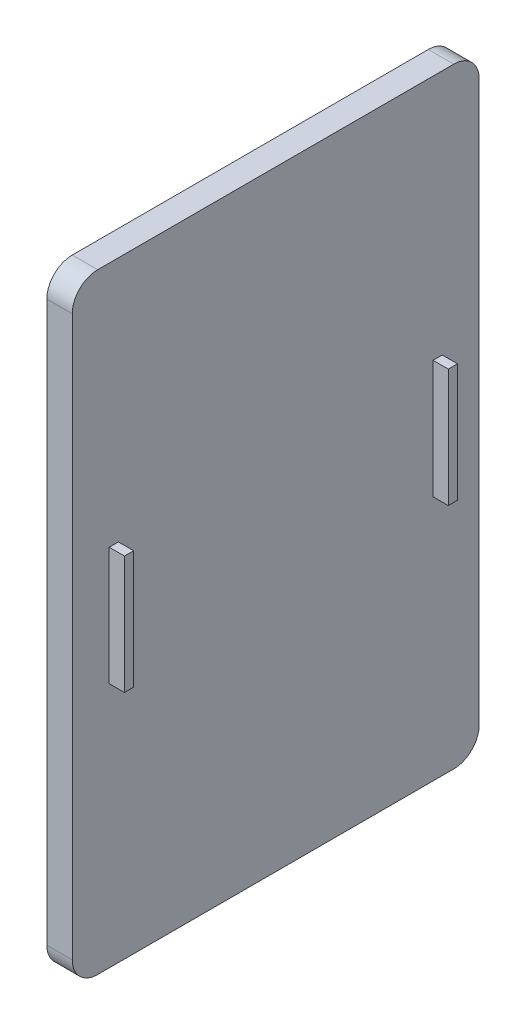
ISO-10303-21;
HEADER;
FILE_DESCRIPTION(('STEP AP214'),'2;1');
FILE_NAME('part.step','',(''),(''),'','','');
FILE_SCHEMA(('AUTOMOTIVE_DESIGN { 1 0 10303 214 1 1 1 1 }'));
ENDSEC;
DATA;
#1=APPLICATION_CONTEXT('core data for automotive mechanical design processes');
#2=APPLICATION_PROTOCOL_DEFINITION('international standard','automotive_design',2000,#1);
#3=PRODUCT_CONTEXT('',#1,'mechanical');
#4=PRODUCT('Part','Part','',(#3));
#5=PRODUCT_RELATED_PRODUCT_CATEGORY('part','',(#4));
#6=PRODUCT_DEFINITION_FORMATION('','',#4);
#7=PRODUCT_DEFINITION_CONTEXT('part definition',#1,'design');
#8=PRODUCT_DEFINITION('design','',#6,#7);
#9=PRODUCT_DEFINITION_SHAPE('','',#8);
#10=(LENGTH_UNIT() NAMED_UNIT(*) SI_UNIT(.MILLI.,.METRE.));
#11=(NAMED_UNIT(*) PLANE_ANGLE_UNIT() SI_UNIT($,.RADIAN.));
#12=(NAMED_UNIT(*) SI_UNIT($,.STERADIAN.) SOLID_ANGLE_UNIT());
#13=UNCERTAINTY_MEASURE_WITH_UNIT(LENGTH_MEASURE(1.E-05),#10,'distance_accuracy_value','');
#14=(GEOMETRIC_REPRESENTATION_CONTEXT(3) GLOBAL_UNCERTAINTY_ASSIGNED_CONTEXT((#13)) GLOBAL_UNIT_ASSIGNED_CONTEXT((#10,
#11,#12)) REPRESENTATION_CONTEXT('',''));
#15=CARTESIAN_POINT('',(0.,0.,0.));
#16=DIRECTION('',(0.,0.,1.));
#17=DIRECTION('',(1.,0.,0.));
#18=AXIS2_PLACEMENT_3D('',#15,#16,#17);
#19=CARTESIAN_POINT('',(5.,0.,0.));
#20=DIRECTION('',(1.,0.,0.));
#21=DIRECTION('',(0.,0.,-1.));
#22=AXIS2_PLACEMENT_3D('',#19,#20,#21);
#23=PLANE('',#22);
#24=DIRECTION('',(0.,1.,0.));
#25=VECTOR('',#24,1.);
#26=CARTESIAN_POINT('',(5.,11.6153180634238,-30.9245104378546));
#27=LINE('',#26,#25);
#28=CARTESIAN_POINT('',(5.,-11.6153180634238,-30.9245104378546));
#29=VERTEX_POINT('',#28);
#30=CARTESIAN_POINT('',(5.,11.6153180634238,-30.9245104378546));
#31=VERTEX_POINT('',#30);
#32=EDGE_CURVE('E151',#29,#31,#27,.T.);
#33=ORIENTED_EDGE('',*,*,#32,.T.);
#34=DIRECTION('',(0.,0.,-1.));
#35=VECTOR('',#34,1.);
#36=CARTESIAN_POINT('',(5.,11.6153180634238,-32.7289287815984));
#37=LINE('',#36,#35);
#38=CARTESIAN_POINT('',(5.,11.6153180634238,-32.7289287815984));
#39=VERTEX_POINT('',#38);
#40=EDGE_CURVE('E165',#31,#39,#37,.T.);
#41=ORIENTED_EDGE('',*,*,#40,.T.);
#42=DIRECTION('',(0.,-1.,0.));
#43=VECTOR('',#42,1.);
#44=CARTESIAN_POINT('',(5.,11.6153180634238,-32.7289287815984));
#45=LINE('',#44,#43);
#46=CARTESIAN_POINT('',(5.,-11.6153180634238,-32.7289287815984));
#47=VERTEX_POINT('',#46);
#48=EDGE_CURVE('E53',#39,#47,#45,.T.);
#49=ORIENTED_EDGE('',*,*,#48,.T.);
#50=DIRECTION('',(0.,0.,1.));
#51=VECTOR('',#50,1.);
#52=CARTESIAN_POINT('',(5.,-11.6153180634238,-32.7289287815984));
#53=LINE('',#52,#51);
#54=EDGE_CURVE('E48',#47,#29,#53,.T.);
#55=ORIENTED_EDGE('',*,*,#54,.T.);
#56=EDGE_LOOP('',(#33,#41,#49,#55));
#57=FACE_BOUND('',#56,.T.);
#58=DIRECTION('',(0.,-1.,0.));
#59=VECTOR('',#58,1.);
#60=CARTESIAN_POINT('',(5.,60.,40.));
#61=LINE('',#60,#59);
#62=CARTESIAN_POINT('',(5.,55.,40.));
#63=VERTEX_POINT('',#62);
#64=CARTESIAN_POINT('',(5.,-55.,40.));
#65=VERTEX_POINT('',#64);
#66=EDGE_CURVE('E219',#63,#65,#61,.T.);
#67=ORIENTED_EDGE('',*,*,#66,.T.);
#68=CARTESIAN_POINT('',(5.,-55.,35.));
#69=DIRECTION('',(1.,0.,0.));
#70=DIRECTION('',(0.,0.,-1.));
#71=AXIS2_PLACEMENT_3D('',#68,#69,#70);
#72=CIRCLE('',#71,5.);
#73=CARTESIAN_POINT('',(5.,-60.,35.));
#74=VERTEX_POINT('',#73);
#75=EDGE_CURVE('E259',#65,#74,#72,.T.);
#76=ORIENTED_EDGE('',*,*,#75,.T.);
#77=DIRECTION('',(0.,0.,-1.));
#78=VECTOR('',#77,1.);
#79=CARTESIAN_POINT('',(5.,-60.,40.));
#80=LINE('',#79,#78);
#81=CARTESIAN_POINT('',(5.,-60.,-35.));
#82=VERTEX_POINT('',#81);
#83=EDGE_CURVE('E222',#74,#82,#80,.T.);
#84=ORIENTED_EDGE('',*,*,#83,.T.);
#85=CARTESIAN_POINT('',(5.,-55.,-35.));
#86=DIRECTION('',(1.,0.,0.));
#87=DIRECTION('',(0.,0.,-1.));
#88=AXIS2_PLACEMENT_3D('',#85,#86,#87);
#89=CIRCLE('',#88,5.);
#90=CARTESIAN_POINT('',(5.,-55.,-40.));
#91=VERTEX_POINT('',#90);
#92=EDGE_CURVE('E257',#82,#91,#89,.T.);
#93=ORIENTED_EDGE('',*,*,#92,.T.);
#94=DIRECTION('',(0.,1.,0.));
#95=VECTOR('',#94,1.);
#96=CARTESIAN_POINT('',(5.,60.,-40.));
#97=LINE('',#96,#95);
#98=CARTESIAN_POINT('',(5.,55.,-40.));
#99=VERTEX_POINT('',#98);
#100=EDGE_CURVE('E212',#91,#99,#97,.T.);
#101=ORIENTED_EDGE('',*,*,#100,.T.);
#102=CARTESIAN_POINT('',(5.,55.,-35.));
#103=DIRECTION('',(1.,0.,0.));
#104=DIRECTION('',(0.,0.,-1.));
#105=AXIS2_PLACEMENT_3D('',#102,#103,#104);
#106=CIRCLE('',#105,5.);
#107=CARTESIAN_POINT('',(5.,60.,-35.));
#108=VERTEX_POINT('',#107);
#109=EDGE_CURVE('E255',#99,#108,#106,.T.);
#110=ORIENTED_EDGE('',*,*,#109,.T.);
#111=DIRECTION('',(0.,0.,1.));
#112=VECTOR('',#111,1.);
#113=CARTESIAN_POINT('',(5.,60.,40.));
#114=LINE('',#113,#112);
#115=CARTESIAN_POINT('',(5.,60.,35.));
#116=VERTEX_POINT('',#115);
#117=EDGE_CURVE('E215',#108,#116,#114,.T.);
#118=ORIENTED_EDGE('',*,*,#117,.T.);
#119=CARTESIAN_POINT('',(5.,55.,35.));
#120=DIRECTION('',(1.,0.,0.));
#121=DIRECTION('',(0.,0.,-1.));
#122=AXIS2_PLACEMENT_3D('',#119,#120,#121);
#123=CIRCLE('',#122,5.);
#124=EDGE_CURVE('E253',#116,#63,#123,.T.);
#125=ORIENTED_EDGE('',*,*,#124,.T.);
#126=EDGE_LOOP('',(#67,#76,#84,#93,#101,#110,#118,#125));
#127=FACE_BOUND('',#126,.T.);
#128=DIRECTION('',(0.,0.,1.));
#129=VECTOR('',#128,1.);
#130=CARTESIAN_POINT('',(5.,11.6153180634238,32.7289287815984));
#131=LINE('',#130,#129);
#132=CARTESIAN_POINT('',(5.,11.6153180634238,30.9245104378546));
#133=VERTEX_POINT('',#132);
#134=CARTESIAN_POINT('',(5.,11.6153180634238,32.7289287815984));
#135=VERTEX_POINT('',#134);
#136=EDGE_CURVE('E196',#133,#135,#131,.T.);
#137=ORIENTED_EDGE('',*,*,#136,.F.);
#138=DIRECTION('',(0.,1.,0.));
#139=VECTOR('',#138,1.);
#140=CARTESIAN_POINT('',(5.,11.6153180634238,30.9245104378546));
#141=LINE('',#140,#139);
#142=CARTESIAN_POINT('',(5.,-11.6153180634238,30.9245104378546));
#143=VERTEX_POINT('',#142);
#144=EDGE_CURVE('E154',#143,#133,#141,.T.);
#145=ORIENTED_EDGE('',*,*,#144,.F.);
#146=DIRECTION('',(0.,0.,-1.));
#147=VECTOR('',#146,1.);
#148=CARTESIAN_POINT('',(5.,-11.6153180634238,32.7289287815984));
#149=LINE('',#148,#147);
#150=CARTESIAN_POINT('',(5.,-11.6153180634238,32.7289287815984));
#151=VERTEX_POINT('',#150);
#152=EDGE_CURVE('E187',#151,#143,#149,.T.);
#153=ORIENTED_EDGE('',*,*,#152,.F.);
#154=DIRECTION('',(0.,-1.,0.));
#155=VECTOR('',#154,1.);
#156=CARTESIAN_POINT('',(5.,11.6153180634238,32.7289287815984));
#157=LINE('',#156,#155);
#158=EDGE_CURVE('E198',#135,#151,#157,.T.);
#159=ORIENTED_EDGE('',*,*,#158,.F.);
#160=EDGE_LOOP('',(#137,#145,#153,#159));
#161=FACE_BOUND('',#160,.T.);
#162=ADVANCED_FACE('F33',(#57,#127,#161),#23,.T.);
#163=CARTESIAN_POINT('',(5.,60.,-40.));
#164=DIRECTION('',(0.,0.,1.));
#165=DIRECTION('',(0.,-1.,0.));
#166=AXIS2_PLACEMENT_3D('',#163,#164,#165);
#167=PLANE('',#166);
#168=ORIENTED_EDGE('',*,*,#100,.F.);
#169=DIRECTION('',(-1.,0.,0.));
#170=VECTOR('',#169,1.);
#171=CARTESIAN_POINT('',(5.,-55.,-40.));
#172=LINE('',#171,#170);
#173=CARTESIAN_POINT('',(0.,-55.,-40.));
#174=VERTEX_POINT('',#173);
#175=EDGE_CURVE('E263',#91,#174,#172,.T.);
#176=ORIENTED_EDGE('',*,*,#175,.T.);
#177=DIRECTION('',(0.,1.,0.));
#178=VECTOR('',#177,1.);
#179=CARTESIAN_POINT('',(0.,60.,-40.));
#180=LINE('',#179,#178);
#181=CARTESIAN_POINT('',(0.,55.,-40.));
#182=VERTEX_POINT('',#181);
#183=EDGE_CURVE('E211',#174,#182,#180,.T.);
#184=ORIENTED_EDGE('',*,*,#183,.T.);
#185=DIRECTION('',(-1.,0.,0.));
#186=VECTOR('',#185,1.);
#187=CARTESIAN_POINT('',(5.,55.,-40.));
#188=LINE('',#187,#186);
#189=EDGE_CURVE('E261',#182,#99,#188,.F.);
#190=ORIENTED_EDGE('',*,*,#189,.T.);
#191=EDGE_LOOP('',(#168,#176,#184,#190));
#192=FACE_BOUND('',#191,.T.);
#193=ADVANCED_FACE('F300',(#192),#167,.F.);
#194=CARTESIAN_POINT('',(5.,60.,40.));
#195=DIRECTION('',(0.,-1.,0.));
#196=DIRECTION('',(0.,0.,-1.));
#197=AXIS2_PLACEMENT_3D('',#194,#195,#196);
#198=PLANE('',#197);
#199=ORIENTED_EDGE('',*,*,#117,.F.);
#200=DIRECTION('',(-1.,0.,0.));
#201=VECTOR('',#200,1.);
#202=CARTESIAN_POINT('',(5.,60.,-35.));
#203=LINE('',#202,#201);
#204=CARTESIAN_POINT('',(0.,60.,-35.));
#205=VERTEX_POINT('',#204);
#206=EDGE_CURVE('E11',#108,#205,#203,.T.);
#207=ORIENTED_EDGE('',*,*,#206,.T.);
#208=DIRECTION('',(0.,0.,1.));
#209=VECTOR('',#208,1.);
#210=CARTESIAN_POINT('',(0.,60.,40.));
#211=LINE('',#210,#209);
#212=CARTESIAN_POINT('',(0.,60.,35.));
#213=VERTEX_POINT('',#212);
#214=EDGE_CURVE('E228',#205,#213,#211,.T.);
#215=ORIENTED_EDGE('',*,*,#214,.T.);
#216=DIRECTION('',(-1.,0.,0.));
#217=VECTOR('',#216,1.);
#218=CARTESIAN_POINT('',(5.,60.,35.));
#219=LINE('',#218,#217);
#220=EDGE_CURVE('E41',#213,#116,#219,.F.);
#221=ORIENTED_EDGE('',*,*,#220,.T.);
#222=EDGE_LOOP('',(#199,#207,#215,#221));
#223=FACE_BOUND('',#222,.T.);
#224=ADVANCED_FACE('F268',(#223),#198,.F.);
#225=CARTESIAN_POINT('',(5.,60.,40.));
#226=DIRECTION('',(0.,0.,-1.));
#227=DIRECTION('',(0.,1.,0.));
#228=AXIS2_PLACEMENT_3D('',#225,#226,#227);
#229=PLANE('',#228);
#230=DIRECTION('',(0.,-1.,0.));
#231=VECTOR('',#230,1.);
#232=CARTESIAN_POINT('',(0.,60.,40.));
#233=LINE('',#232,#231);
#234=CARTESIAN_POINT('',(0.,55.,40.));
#235=VERTEX_POINT('',#234);
#236=CARTESIAN_POINT('',(0.,-55.,40.));
#237=VERTEX_POINT('',#236);
#238=EDGE_CURVE('E231',#235,#237,#233,.T.);
#239=ORIENTED_EDGE('',*,*,#238,.T.);
#240=DIRECTION('',(-1.,0.,0.));
#241=VECTOR('',#240,1.);
#242=CARTESIAN_POINT('',(5.,-55.,40.));
#243=LINE('',#242,#241);
#244=EDGE_CURVE('E251',#237,#65,#243,.F.);
#245=ORIENTED_EDGE('',*,*,#244,.T.);
#246=ORIENTED_EDGE('',*,*,#66,.F.);
#247=DIRECTION('',(-1.,0.,0.));
#248=VECTOR('',#247,1.);
#249=CARTESIAN_POINT('',(5.,55.,40.));
#250=LINE('',#249,#248);
#251=EDGE_CURVE('E248',#63,#235,#250,.T.);
#252=ORIENTED_EDGE('',*,*,#251,.T.);
#253=EDGE_LOOP('',(#239,#245,#246,#252));
#254=FACE_BOUND('',#253,.T.);
#255=ADVANCED_FACE('F280',(#254),#229,.F.);
#256=CARTESIAN_POINT('',(5.,-60.,40.));
#257=DIRECTION('',(0.,1.,0.));
#258=DIRECTION('',(0.,0.,1.));
#259=AXIS2_PLACEMENT_3D('',#256,#257,#258);
#260=PLANE('',#259);
#261=ORIENTED_EDGE('',*,*,#83,.F.);
#262=DIRECTION('',(-1.,0.,0.));
#263=VECTOR('',#262,1.);
#264=CARTESIAN_POINT('',(5.,-60.,35.));
#265=LINE('',#264,#263);
#266=CARTESIAN_POINT('',(0.,-60.,35.));
#267=VERTEX_POINT('',#266);
#268=EDGE_CURVE('E237',#74,#267,#265,.T.);
#269=ORIENTED_EDGE('',*,*,#268,.T.);
#270=DIRECTION('',(0.,0.,-1.));
#271=VECTOR('',#270,1.);
#272=CARTESIAN_POINT('',(0.,-60.,40.));
#273=LINE('',#272,#271);
#274=CARTESIAN_POINT('',(0.,-60.,-35.));
#275=VERTEX_POINT('',#274);
#276=EDGE_CURVE('E216',#267,#275,#273,.T.);
#277=ORIENTED_EDGE('',*,*,#276,.T.);
#278=DIRECTION('',(-1.,0.,0.));
#279=VECTOR('',#278,1.);
#280=CARTESIAN_POINT('',(5.,-60.,-35.));
#281=LINE('',#280,#279);
#282=EDGE_CURVE('E225',#275,#82,#281,.F.);
#283=ORIENTED_EDGE('',*,*,#282,.T.);
#284=EDGE_LOOP('',(#261,#269,#277,#283));
#285=FACE_BOUND('',#284,.T.);
#286=ADVANCED_FACE('F291',(#285),#260,.F.);
#287=CARTESIAN_POINT('',(0.,0.,0.));
#288=DIRECTION('',(1.,0.,0.));
#289=DIRECTION('',(0.,0.,-1.));
#290=AXIS2_PLACEMENT_3D('',#287,#288,#289);
#291=PLANE('',#290);
#292=ORIENTED_EDGE('',*,*,#276,.F.);
#293=CARTESIAN_POINT('',(0.,-55.,35.));
#294=DIRECTION('',(1.,0.,0.));
#295=DIRECTION('',(0.,0.,-1.));
#296=AXIS2_PLACEMENT_3D('',#293,#294,#295);
#297=CIRCLE('',#296,5.);
#298=EDGE_CURVE('E246',#267,#237,#297,.F.);
#299=ORIENTED_EDGE('',*,*,#298,.T.);
#300=ORIENTED_EDGE('',*,*,#238,.F.);
#301=CARTESIAN_POINT('',(0.,55.,35.));
#302=DIRECTION('',(1.,0.,0.));
#303=DIRECTION('',(0.,0.,-1.));
#304=AXIS2_PLACEMENT_3D('',#301,#302,#303);
#305=CIRCLE('',#304,5.);
#306=EDGE_CURVE('E240',#235,#213,#305,.F.);
#307=ORIENTED_EDGE('',*,*,#306,.T.);
#308=ORIENTED_EDGE('',*,*,#214,.F.);
#309=CARTESIAN_POINT('',(0.,55.,-35.));
#310=DIRECTION('',(1.,0.,0.));
#311=DIRECTION('',(0.,0.,-1.));
#312=AXIS2_PLACEMENT_3D('',#309,#310,#311);
#313=CIRCLE('',#312,5.);
#314=EDGE_CURVE('E242',#205,#182,#313,.F.);
#315=ORIENTED_EDGE('',*,*,#314,.T.);
#316=ORIENTED_EDGE('',*,*,#183,.F.);
#317=CARTESIAN_POINT('',(0.,-55.,-35.));
#318=DIRECTION('',(1.,0.,0.));
#319=DIRECTION('',(0.,0.,-1.));
#320=AXIS2_PLACEMENT_3D('',#317,#318,#319);
#321=CIRCLE('',#320,5.);
#322=EDGE_CURVE('E244',#174,#275,#321,.F.);
#323=ORIENTED_EDGE('',*,*,#322,.T.);
#324=EDGE_LOOP('',(#292,#299,#300,#307,#308,#315,#316,#323));
#325=FACE_BOUND('',#324,.T.);
#326=ADVANCED_FACE('F284',(#325),#291,.F.);
#327=CARTESIAN_POINT('',(5.,-55.,35.));
#328=DIRECTION('',(-1.,0.,0.));
#329=DIRECTION('',(0.,0.,1.));
#330=AXIS2_PLACEMENT_3D('',#327,#328,#329);
#331=CYLINDRICAL_SURFACE('',#330,5.);
#332=ORIENTED_EDGE('',*,*,#75,.F.);
#333=ORIENTED_EDGE('',*,*,#244,.F.);
#334=ORIENTED_EDGE('',*,*,#298,.F.);
#335=ORIENTED_EDGE('',*,*,#268,.F.);
#336=EDGE_LOOP('',(#332,#333,#334,#335));
#337=FACE_BOUND('',#336,.T.);
#338=ADVANCED_FACE('F288',(#337),#331,.T.);
#339=CARTESIAN_POINT('',(5.,-55.,-35.));
#340=DIRECTION('',(-1.,0.,0.));
#341=DIRECTION('',(0.,0.,1.));
#342=AXIS2_PLACEMENT_3D('',#339,#340,#341);
#343=CYLINDRICAL_SURFACE('',#342,5.);
#344=ORIENTED_EDGE('',*,*,#92,.F.);
#345=ORIENTED_EDGE('',*,*,#282,.F.);
#346=ORIENTED_EDGE('',*,*,#322,.F.);
#347=ORIENTED_EDGE('',*,*,#175,.F.);
#348=EDGE_LOOP('',(#344,#345,#346,#347));
#349=FACE_BOUND('',#348,.T.);
#350=ADVANCED_FACE('F297',(#349),#343,.T.);
#351=CARTESIAN_POINT('',(5.,55.,-35.));
#352=DIRECTION('',(-1.,0.,0.));
#353=DIRECTION('',(0.,0.,1.));
#354=AXIS2_PLACEMENT_3D('',#351,#352,#353);
#355=CYLINDRICAL_SURFACE('',#354,5.);
#356=ORIENTED_EDGE('',*,*,#109,.F.);
#357=ORIENTED_EDGE('',*,*,#189,.F.);
#358=ORIENTED_EDGE('',*,*,#314,.F.);
#359=ORIENTED_EDGE('',*,*,#206,.F.);
#360=EDGE_LOOP('',(#356,#357,#358,#359));
#361=FACE_BOUND('',#360,.T.);
#362=ADVANCED_FACE('F303',(#361),#355,.T.);
#363=CARTESIAN_POINT('',(5.,55.,35.));
#364=DIRECTION('',(-1.,0.,0.));
#365=DIRECTION('',(0.,0.,1.));
#366=AXIS2_PLACEMENT_3D('',#363,#364,#365);
#367=CYLINDRICAL_SURFACE('',#366,5.);
#368=ORIENTED_EDGE('',*,*,#124,.F.);
#369=ORIENTED_EDGE('',*,*,#220,.F.);
#370=ORIENTED_EDGE('',*,*,#306,.F.);
#371=ORIENTED_EDGE('',*,*,#251,.F.);
#372=EDGE_LOOP('',(#368,#369,#370,#371));
#373=FACE_BOUND('',#372,.T.);
#374=ADVANCED_FACE('F35',(#373),#367,.T.);
#375=CARTESIAN_POINT('',(8.,11.6153180634238,30.9245104378546));
#376=DIRECTION('',(0.,0.,1.));
#377=DIRECTION('',(1.,0.,0.));
#378=AXIS2_PLACEMENT_3D('',#375,#376,#377);
#379=PLANE('',#378);
#380=ORIENTED_EDGE('',*,*,#144,.T.);
#381=DIRECTION('',(-1.,0.,0.));
#382=VECTOR('',#381,1.);
#383=CARTESIAN_POINT('',(8.,11.6153180634238,30.9245104378546));
#384=LINE('',#383,#382);
#385=CARTESIAN_POINT('',(8.,11.6153180634238,30.9245104378546));
#386=VERTEX_POINT('',#385);
#387=EDGE_CURVE('E209',#386,#133,#384,.T.);
#388=ORIENTED_EDGE('',*,*,#387,.F.);
#389=DIRECTION('',(0.,1.,0.));
#390=VECTOR('',#389,1.);
#391=CARTESIAN_POINT('',(8.,11.6153180634238,30.9245104378546));
#392=LINE('',#391,#390);
#393=CARTESIAN_POINT('',(8.,-11.6153180634238,30.9245104378546));
#394=VERTEX_POINT('',#393);
#395=EDGE_CURVE('E183',#394,#386,#392,.T.);
#396=ORIENTED_EDGE('',*,*,#395,.F.);
#397=DIRECTION('',(-1.,0.,0.));
#398=VECTOR('',#397,1.);
#399=CARTESIAN_POINT('',(8.,-11.6153180634238,30.9245104378546));
#400=LINE('',#399,#398);
#401=EDGE_CURVE('E193',#394,#143,#400,.T.);
#402=ORIENTED_EDGE('',*,*,#401,.T.);
#403=EDGE_LOOP('',(#380,#388,#396,#402));
#404=FACE_BOUND('',#403,.T.);
#405=ADVANCED_FACE('F309',(#404),#379,.F.);
#406=CARTESIAN_POINT('',(8.,11.6153180634238,32.7289287815984));
#407=DIRECTION('',(0.,-1.,0.));
#408=DIRECTION('',(0.,0.,-1.));
#409=AXIS2_PLACEMENT_3D('',#406,#407,#408);
#410=PLANE('',#409);
#411=ORIENTED_EDGE('',*,*,#136,.T.);
#412=DIRECTION('',(-1.,0.,0.));
#413=VECTOR('',#412,1.);
#414=CARTESIAN_POINT('',(8.,11.6153180634238,32.7289287815984));
#415=LINE('',#414,#413);
#416=CARTESIAN_POINT('',(8.,11.6153180634238,32.7289287815984));
#417=VERTEX_POINT('',#416);
#418=EDGE_CURVE('E206',#417,#135,#415,.T.);
#419=ORIENTED_EDGE('',*,*,#418,.F.);
#420=DIRECTION('',(0.,0.,1.));
#421=VECTOR('',#420,1.);
#422=CARTESIAN_POINT('',(8.,11.6153180634238,32.7289287815984));
#423=LINE('',#422,#421);
#424=EDGE_CURVE('E186',#386,#417,#423,.T.);
#425=ORIENTED_EDGE('',*,*,#424,.F.);
#426=ORIENTED_EDGE('',*,*,#387,.T.);
#427=EDGE_LOOP('',(#411,#419,#425,#426));
#428=FACE_BOUND('',#427,.T.);
#429=ADVANCED_FACE('F357',(#428),#410,.F.);
#430=CARTESIAN_POINT('',(8.,11.6153180634238,32.7289287815984));
#431=DIRECTION('',(0.,0.,-1.));
#432=DIRECTION('',(-1.,0.,0.));
#433=AXIS2_PLACEMENT_3D('',#430,#431,#432);
#434=PLANE('',#433);
#435=ORIENTED_EDGE('',*,*,#158,.T.);
#436=DIRECTION('',(-1.,0.,0.));
#437=VECTOR('',#436,1.);
#438=CARTESIAN_POINT('',(8.,-11.6153180634238,32.7289287815984));
#439=LINE('',#438,#437);
#440=CARTESIAN_POINT('',(8.,-11.6153180634238,32.7289287815984));
#441=VERTEX_POINT('',#440);
#442=EDGE_CURVE('E204',#441,#151,#439,.T.);
#443=ORIENTED_EDGE('',*,*,#442,.F.);
#444=DIRECTION('',(0.,-1.,0.));
#445=VECTOR('',#444,1.);
#446=CARTESIAN_POINT('',(8.,11.6153180634238,32.7289287815984));
#447=LINE('',#446,#445);
#448=EDGE_CURVE('E189',#417,#441,#447,.T.);
#449=ORIENTED_EDGE('',*,*,#448,.F.);
#450=ORIENTED_EDGE('',*,*,#418,.T.);
#451=EDGE_LOOP('',(#435,#443,#449,#450));
#452=FACE_BOUND('',#451,.T.);
#453=ADVANCED_FACE('F366',(#452),#434,.F.);
#454=CARTESIAN_POINT('',(8.,-11.6153180634238,32.7289287815984));
#455=DIRECTION('',(0.,1.,0.));
#456=DIRECTION('',(0.,0.,1.));
#457=AXIS2_PLACEMENT_3D('',#454,#455,#456);
#458=PLANE('',#457);
#459=ORIENTED_EDGE('',*,*,#152,.T.);
#460=ORIENTED_EDGE('',*,*,#401,.F.);
#461=DIRECTION('',(0.,0.,-1.));
#462=VECTOR('',#461,1.);
#463=CARTESIAN_POINT('',(8.,-11.6153180634238,32.7289287815984));
#464=LINE('',#463,#462);
#465=EDGE_CURVE('E191',#441,#394,#464,.T.);
#466=ORIENTED_EDGE('',*,*,#465,.F.);
#467=ORIENTED_EDGE('',*,*,#442,.T.);
#468=EDGE_LOOP('',(#459,#460,#466,#467));
#469=FACE_BOUND('',#468,.T.);
#470=ADVANCED_FACE('F375',(#469),#458,.F.);
#471=CARTESIAN_POINT('',(8.,0.,0.));
#472=DIRECTION('',(1.,0.,0.));
#473=DIRECTION('',(0.,0.,-1.));
#474=AXIS2_PLACEMENT_3D('',#471,#472,#473);
#475=PLANE('',#474);
#476=ORIENTED_EDGE('',*,*,#395,.T.);
#477=ORIENTED_EDGE('',*,*,#424,.T.);
#478=ORIENTED_EDGE('',*,*,#448,.T.);
#479=ORIENTED_EDGE('',*,*,#465,.T.);
#480=EDGE_LOOP('',(#476,#477,#478,#479));
#481=FACE_BOUND('',#480,.T.);
#482=ADVANCED_FACE('F385',(#481),#475,.T.);
#483=CARTESIAN_POINT('',(8.,11.6153180634238,-30.9245104378546));
#484=DIRECTION('',(0.,0.,1.));
#485=DIRECTION('',(1.,0.,0.));
#486=AXIS2_PLACEMENT_3D('',#483,#484,#485);
#487=PLANE('',#486);
#488=ORIENTED_EDGE('',*,*,#32,.F.);
#489=DIRECTION('',(-1.,0.,0.));
#490=VECTOR('',#489,1.);
#491=CARTESIAN_POINT('',(8.,-11.6153180634238,-30.9245104378546));
#492=LINE('',#491,#490);
#493=CARTESIAN_POINT('',(8.,-11.6153180634238,-30.9245104378546));
#494=VERTEX_POINT('',#493);
#495=EDGE_CURVE('E145',#494,#29,#492,.T.);
#496=ORIENTED_EDGE('',*,*,#495,.F.);
#497=DIRECTION('',(0.,1.,0.));
#498=VECTOR('',#497,1.);
#499=CARTESIAN_POINT('',(8.,11.6153180634238,-30.9245104378546));
#500=LINE('',#499,#498);
#501=CARTESIAN_POINT('',(8.,11.6153180634238,-30.9245104378546));
#502=VERTEX_POINT('',#501);
#503=EDGE_CURVE('E149',#494,#502,#500,.T.);
#504=ORIENTED_EDGE('',*,*,#503,.T.);
#505=DIRECTION('',(-1.,0.,0.));
#506=VECTOR('',#505,1.);
#507=CARTESIAN_POINT('',(8.,11.6153180634238,-30.9245104378546));
#508=LINE('',#507,#506);
#509=EDGE_CURVE('E173',#502,#31,#508,.T.);
#510=ORIENTED_EDGE('',*,*,#509,.T.);
#511=EDGE_LOOP('',(#488,#496,#504,#510));
#512=FACE_BOUND('',#511,.T.);
#513=ADVANCED_FACE('F147',(#512),#487,.T.);
#514=CARTESIAN_POINT('',(8.,-11.6153180634238,-32.7289287815984));
#515=DIRECTION('',(0.,-1.,0.));
#516=DIRECTION('',(0.,0.,-1.));
#517=AXIS2_PLACEMENT_3D('',#514,#515,#516);
#518=PLANE('',#517);
#519=ORIENTED_EDGE('',*,*,#54,.F.);
#520=DIRECTION('',(-1.,0.,0.));
#521=VECTOR('',#520,1.);
#522=CARTESIAN_POINT('',(8.,-11.6153180634238,-32.7289287815984));
#523=LINE('',#522,#521);
#524=CARTESIAN_POINT('',(8.,-11.6153180634238,-32.7289287815984));
#525=VERTEX_POINT('',#524);
#526=EDGE_CURVE('E155',#525,#47,#523,.T.);
#527=ORIENTED_EDGE('',*,*,#526,.F.);
#528=DIRECTION('',(0.,0.,1.));
#529=VECTOR('',#528,1.);
#530=CARTESIAN_POINT('',(8.,-11.6153180634238,-32.7289287815984));
#531=LINE('',#530,#529);
#532=EDGE_CURVE('E161',#525,#494,#531,.T.);
#533=ORIENTED_EDGE('',*,*,#532,.T.);
#534=ORIENTED_EDGE('',*,*,#495,.T.);
#535=EDGE_LOOP('',(#519,#527,#533,#534));
#536=FACE_BOUND('',#535,.T.);
#537=ADVANCED_FACE('F167',(#536),#518,.T.);
#538=CARTESIAN_POINT('',(8.,11.6153180634238,-32.7289287815984));
#539=DIRECTION('',(0.,0.,-1.));
#540=DIRECTION('',(-1.,0.,0.));
#541=AXIS2_PLACEMENT_3D('',#538,#539,#540);
#542=PLANE('',#541);
#543=ORIENTED_EDGE('',*,*,#48,.F.);
#544=DIRECTION('',(-1.,0.,0.));
#545=VECTOR('',#544,1.);
#546=CARTESIAN_POINT('',(8.,11.6153180634238,-32.7289287815984));
#547=LINE('',#546,#545);
#548=CARTESIAN_POINT('',(8.,11.6153180634238,-32.7289287815984));
#549=VERTEX_POINT('',#548);
#550=EDGE_CURVE('E179',#549,#39,#547,.T.);
#551=ORIENTED_EDGE('',*,*,#550,.F.);
#552=DIRECTION('',(0.,-1.,0.));
#553=VECTOR('',#552,1.);
#554=CARTESIAN_POINT('',(8.,11.6153180634238,-32.7289287815984));
#555=LINE('',#554,#553);
#556=EDGE_CURVE('E168',#549,#525,#555,.T.);
#557=ORIENTED_EDGE('',*,*,#556,.T.);
#558=ORIENTED_EDGE('',*,*,#526,.T.);
#559=EDGE_LOOP('',(#543,#551,#557,#558));
#560=FACE_BOUND('',#559,.T.);
#561=ADVANCED_FACE('F415',(#560),#542,.T.);
#562=CARTESIAN_POINT('',(8.,11.6153180634238,-32.7289287815984));
#563=DIRECTION('',(0.,1.,0.));
#564=DIRECTION('',(0.,0.,1.));
#565=AXIS2_PLACEMENT_3D('',#562,#563,#564);
#566=PLANE('',#565);
#567=ORIENTED_EDGE('',*,*,#40,.F.);
#568=ORIENTED_EDGE('',*,*,#509,.F.);
#569=DIRECTION('',(0.,0.,-1.));
#570=VECTOR('',#569,1.);
#571=CARTESIAN_POINT('',(8.,11.6153180634238,-32.7289287815984));
#572=LINE('',#571,#570);
#573=EDGE_CURVE('E164',#502,#549,#572,.T.);
#574=ORIENTED_EDGE('',*,*,#573,.T.);
#575=ORIENTED_EDGE('',*,*,#550,.T.);
#576=EDGE_LOOP('',(#567,#568,#574,#575));
#577=FACE_BOUND('',#576,.T.);
#578=ADVANCED_FACE('F424',(#577),#566,.T.);
#579=CARTESIAN_POINT('',(8.,0.,0.));
#580=DIRECTION('',(1.,0.,0.));
#581=DIRECTION('',(0.,0.,1.));
#582=AXIS2_PLACEMENT_3D('',#579,#580,#581);
#583=PLANE('',#582);
#584=ORIENTED_EDGE('',*,*,#503,.F.);
#585=ORIENTED_EDGE('',*,*,#532,.F.);
#586=ORIENTED_EDGE('',*,*,#556,.F.);
#587=ORIENTED_EDGE('',*,*,#573,.F.);
#588=EDGE_LOOP('',(#584,#585,#586,#587));
#589=FACE_BOUND('',#588,.T.);
#590=ADVANCED_FACE('F159',(#589),#583,.T.);
#591=CLOSED_SHELL('',(#162,#193,#224,#255,#286,#326,#338,#350,#362,#374,#405,#429,#453,#470,
#482,#513,#537,#561,#578,#590));
#592=MANIFOLD_SOLID_BREP('B2',#591);
#593=ADVANCED_BREP_SHAPE_REPRESENTATION('',(#18,#592),#14);
#594=SHAPE_DEFINITION_REPRESENTATION(#9,#593);
ENDSEC;
END-ISO-10303-21;
